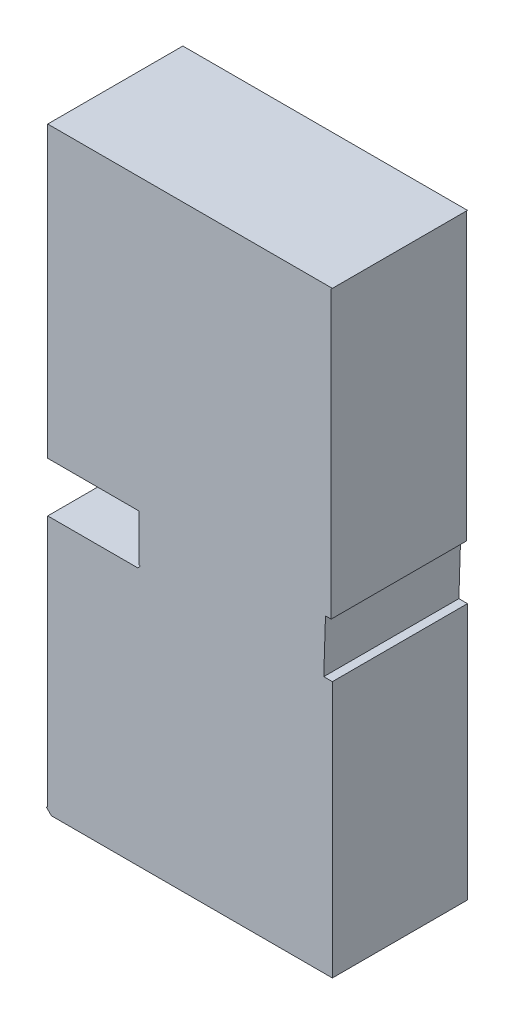
ISO-10303-21;
HEADER;
FILE_DESCRIPTION(('STEP AP214'),'2;1');
FILE_NAME('part.step','',(''),(''),'','','');
FILE_SCHEMA(('AUTOMOTIVE_DESIGN { 1 0 10303 214 1 1 1 1 }'));
ENDSEC;
DATA;
#1=APPLICATION_CONTEXT('core data for automotive mechanical design processes');
#2=APPLICATION_PROTOCOL_DEFINITION('international standard','automotive_design',2000,#1);
#3=PRODUCT_CONTEXT('',#1,'mechanical');
#4=PRODUCT('Part','Part','',(#3));
#5=PRODUCT_RELATED_PRODUCT_CATEGORY('part','',(#4));
#6=PRODUCT_DEFINITION_FORMATION('','',#4);
#7=PRODUCT_DEFINITION_CONTEXT('part definition',#1,'design');
#8=PRODUCT_DEFINITION('design','',#6,#7);
#9=PRODUCT_DEFINITION_SHAPE('','',#8);
#10=(LENGTH_UNIT() NAMED_UNIT(*) SI_UNIT(.MILLI.,.METRE.));
#11=(NAMED_UNIT(*) PLANE_ANGLE_UNIT() SI_UNIT($,.RADIAN.));
#12=(NAMED_UNIT(*) SI_UNIT($,.STERADIAN.) SOLID_ANGLE_UNIT());
#13=UNCERTAINTY_MEASURE_WITH_UNIT(LENGTH_MEASURE(1.E-05),#10,'distance_accuracy_value','');
#14=(GEOMETRIC_REPRESENTATION_CONTEXT(3) GLOBAL_UNCERTAINTY_ASSIGNED_CONTEXT((#13)) GLOBAL_UNIT_ASSIGNED_CONTEXT((#10,
#11,#12)) REPRESENTATION_CONTEXT('',''));
#15=CARTESIAN_POINT('',(0.,0.,0.));
#16=DIRECTION('',(0.,0.,1.));
#17=DIRECTION('',(1.,0.,0.));
#18=AXIS2_PLACEMENT_3D('',#15,#16,#17);
#19=CARTESIAN_POINT('',(1.1635613,2.4310975,1.10000034));
#20=DIRECTION('',(0.,0.,-1.));
#21=DIRECTION('',(0.,-1.,0.));
#22=AXIS2_PLACEMENT_3D('',#19,#20,#21);
#23=PLANE('',#22);
#24=DIRECTION('',(-0.707106781186548,-0.707106781186548,0.));
#25=VECTOR('',#24,1.);
#26=CARTESIAN_POINT('',(1.1635613,2.4310975,1.10000034));
#27=LINE('',#26,#25);
#28=CARTESIAN_POINT('',(1.1635613,2.4310975,1.10000034));
#29=VERTEX_POINT('',#28);
#30=CARTESIAN_POINT('',(1.1536553,2.4211915,1.10000034));
#31=VERTEX_POINT('',#30);
#32=EDGE_CURVE('E294',#29,#31,#27,.T.);
#33=ORIENTED_EDGE('',*,*,#32,.F.);
#34=DIRECTION('',(1.,0.,0.));
#35=VECTOR('',#34,1.);
#36=CARTESIAN_POINT('',(-1.1536807,2.4310975,1.10000034));
#37=LINE('',#36,#35);
#38=CARTESIAN_POINT('',(-1.1536807,2.4310975,1.10000034));
#39=VERTEX_POINT('',#38);
#40=EDGE_CURVE('E28',#39,#29,#37,.T.);
#41=ORIENTED_EDGE('',*,*,#40,.F.);
#42=DIRECTION('',(0.,1.,0.));
#43=VECTOR('',#42,1.);
#44=CARTESIAN_POINT('',(-1.1536807,0.0742569,1.10000034));
#45=LINE('',#44,#43);
#46=CARTESIAN_POINT('',(-1.1536807,0.0742569,1.10000034));
#47=VERTEX_POINT('',#46);
#48=EDGE_CURVE('E285',#47,#39,#45,.T.);
#49=ORIENTED_EDGE('',*,*,#48,.F.);
#50=DIRECTION('',(-1.,0.,0.));
#51=VECTOR('',#50,1.);
#52=CARTESIAN_POINT('',(-0.4109847,0.0742569,1.10000034));
#53=LINE('',#52,#51);
#54=CARTESIAN_POINT('',(-0.4109847,0.0742569,1.10000034));
#55=VERTEX_POINT('',#54);
#56=EDGE_CURVE('E270',#55,#47,#53,.T.);
#57=ORIENTED_EDGE('',*,*,#56,.F.);
#58=DIRECTION('',(0.,1.,0.));
#59=VECTOR('',#58,1.);
#60=CARTESIAN_POINT('',(-0.4109847,-0.3020441,1.10000034));
#61=LINE('',#60,#59);
#62=CARTESIAN_POINT('',(-0.4109847,-0.3020441,1.10000034));
#63=VERTEX_POINT('',#62);
#64=EDGE_CURVE('E259',#63,#55,#61,.T.);
#65=ORIENTED_EDGE('',*,*,#64,.F.);
#66=DIRECTION('',(-0.707106781186548,0.707106781186548,0.));
#67=VECTOR('',#66,1.);
#68=CARTESIAN_POINT('',(-0.4010787,-0.3119501,1.10000034));
#69=LINE('',#68,#67);
#70=CARTESIAN_POINT('',(-0.4010787,-0.3119501,1.10000034));
#71=VERTEX_POINT('',#70);
#72=EDGE_CURVE('E177',#71,#63,#69,.T.);
#73=ORIENTED_EDGE('',*,*,#72,.F.);
#74=DIRECTION('',(0.707106781186548,0.707106781186548,0.));
#75=VECTOR('',#74,1.);
#76=CARTESIAN_POINT('',(-0.4208653,-0.3317367,1.10000034));
#77=LINE('',#76,#75);
#78=CARTESIAN_POINT('',(-0.4208653,-0.3317367,1.10000034));
#79=VERTEX_POINT('',#78);
#80=EDGE_CURVE('E170',#79,#71,#77,.T.);
#81=ORIENTED_EDGE('',*,*,#80,.F.);
#82=DIRECTION('',(1.,0.,0.));
#83=VECTOR('',#82,1.);
#84=CARTESIAN_POINT('',(-1.1536807,-0.3317367,1.10000034));
#85=LINE('',#84,#83);
#86=CARTESIAN_POINT('',(-1.1536807,-0.3317367,1.10000034));
#87=VERTEX_POINT('',#86);
#88=EDGE_CURVE('E174',#87,#79,#85,.T.);
#89=ORIENTED_EDGE('',*,*,#88,.F.);
#90=DIRECTION('',(0.,1.,0.));
#91=VECTOR('',#90,1.);
#92=CARTESIAN_POINT('',(-1.1536807,-2.3816183,1.10000034));
#93=LINE('',#92,#91);
#94=CARTESIAN_POINT('',(-1.1536807,-2.3816183,1.10000034));
#95=VERTEX_POINT('',#94);
#96=EDGE_CURVE('E233',#95,#87,#93,.T.);
#97=ORIENTED_EDGE('',*,*,#96,.F.);
#98=DIRECTION('',(0.707106781186548,0.707106781186548,0.));
#99=VECTOR('',#98,1.);
#100=CARTESIAN_POINT('',(-1.1635613,-2.3914989,1.10000034));
#101=LINE('',#100,#99);
#102=CARTESIAN_POINT('',(-1.1635613,-2.3914989,1.10000034));
#103=VERTEX_POINT('',#102);
#104=EDGE_CURVE('E271',#103,#95,#101,.T.);
#105=ORIENTED_EDGE('',*,*,#104,.F.);
#106=DIRECTION('',(-0.707106781186548,0.707106781186548,0.));
#107=VECTOR('',#106,1.);
#108=CARTESIAN_POINT('',(-1.1239627,-2.4310975,1.10000034));
#109=LINE('',#108,#107);
#110=CARTESIAN_POINT('',(-1.1239627,-2.4310975,1.10000034));
#111=VERTEX_POINT('',#110);
#112=EDGE_CURVE('E225',#111,#103,#109,.T.);
#113=ORIENTED_EDGE('',*,*,#112,.F.);
#114=DIRECTION('',(-1.,0.,0.));
#115=VECTOR('',#114,1.);
#116=CARTESIAN_POINT('',(1.1635613,-2.4310975,1.10000034));
#117=LINE('',#116,#115);
#118=CARTESIAN_POINT('',(1.1635613,-2.4310975,1.10000034));
#119=VERTEX_POINT('',#118);
#120=EDGE_CURVE('E254',#119,#111,#117,.T.);
#121=ORIENTED_EDGE('',*,*,#120,.F.);
#122=DIRECTION('',(0.,-1.,0.));
#123=VECTOR('',#122,1.);
#124=CARTESIAN_POINT('',(1.1635613,-0.3416427,1.10000034));
#125=LINE('',#124,#123);
#126=CARTESIAN_POINT('',(1.1635613,-0.3416427,1.10000034));
#127=VERTEX_POINT('',#126);
#128=EDGE_CURVE('E242',#127,#119,#125,.T.);
#129=ORIENTED_EDGE('',*,*,#128,.F.);
#130=DIRECTION('',(1.,0.,0.));
#131=VECTOR('',#130,1.);
#132=CARTESIAN_POINT('',(1.09340904,-0.3416427,1.10000034));
#133=LINE('',#132,#131);
#134=CARTESIAN_POINT('',(1.09340904,-0.3416427,1.10000034));
#135=VERTEX_POINT('',#134);
#136=EDGE_CURVE('E213',#135,#127,#133,.T.);
#137=ORIENTED_EDGE('',*,*,#136,.F.);
#138=DIRECTION('',(-0.0322887852650993,-0.999478581234287,0.));
#139=VECTOR('',#138,1.);
#140=CARTESIAN_POINT('',(1.10748826,0.0941705,1.10000034));
#141=LINE('',#140,#139);
#142=CARTESIAN_POINT('',(1.10748826,0.0941705,1.10000034));
#143=VERTEX_POINT('',#142);
#144=EDGE_CURVE('E221',#143,#135,#141,.T.);
#145=ORIENTED_EDGE('',*,*,#144,.F.);
#146=DIRECTION('',(-0.999997578459252,0.00220069889625955,0.));
#147=VECTOR('',#146,1.);
#148=CARTESIAN_POINT('',(1.1536553,0.0940689,1.10000034));
#149=LINE('',#148,#147);
#150=CARTESIAN_POINT('',(1.1536553,0.0940689,1.10000034));
#151=VERTEX_POINT('',#150);
#152=EDGE_CURVE('E220',#151,#143,#149,.T.);
#153=ORIENTED_EDGE('',*,*,#152,.F.);
#154=DIRECTION('',(0.,-1.,0.));
#155=VECTOR('',#154,1.);
#156=CARTESIAN_POINT('',(1.1536553,2.4211915,1.10000034));
#157=LINE('',#156,#155);
#158=EDGE_CURVE('E240',#31,#151,#157,.T.);
#159=ORIENTED_EDGE('',*,*,#158,.F.);
#160=EDGE_LOOP('',(#33,#41,#49,#57,#65,#73,#81,#89,#97,#105,#113,#121,#129,#137,#145,#153,#159));
#161=FACE_BOUND('',#160,.T.);
#162=ADVANCED_FACE('F17',(#161),#23,.F.);
#163=CARTESIAN_POINT('',(1.1635613,2.4310975,0.));
#164=DIRECTION('',(0.,0.,-1.));
#165=DIRECTION('',(0.,-1.,0.));
#166=AXIS2_PLACEMENT_3D('',#163,#164,#165);
#167=PLANE('',#166);
#168=DIRECTION('',(-0.707106781186548,-0.707106781186548,0.));
#169=VECTOR('',#168,1.);
#170=CARTESIAN_POINT('',(1.1635613,2.4310975,0.));
#171=LINE('',#170,#169);
#172=CARTESIAN_POINT('',(1.1635613,2.4310975,0.));
#173=VERTEX_POINT('',#172);
#174=CARTESIAN_POINT('',(1.1536553,2.4211915,0.));
#175=VERTEX_POINT('',#174);
#176=EDGE_CURVE('E236',#173,#175,#171,.T.);
#177=ORIENTED_EDGE('',*,*,#176,.T.);
#178=DIRECTION('',(0.,-1.,0.));
#179=VECTOR('',#178,1.);
#180=CARTESIAN_POINT('',(1.1536553,2.4211915,0.));
#181=LINE('',#180,#179);
#182=CARTESIAN_POINT('',(1.1536553,0.0940689,0.));
#183=VERTEX_POINT('',#182);
#184=EDGE_CURVE('E280',#175,#183,#181,.T.);
#185=ORIENTED_EDGE('',*,*,#184,.T.);
#186=DIRECTION('',(-0.999997578459252,0.00220069889625955,0.));
#187=VECTOR('',#186,1.);
#188=CARTESIAN_POINT('',(1.1536553,0.0940689,0.));
#189=LINE('',#188,#187);
#190=CARTESIAN_POINT('',(1.10748826,0.0941705,0.));
#191=VERTEX_POINT('',#190);
#192=EDGE_CURVE('E219',#183,#191,#189,.T.);
#193=ORIENTED_EDGE('',*,*,#192,.T.);
#194=DIRECTION('',(-0.0322887852650993,-0.999478581234287,0.));
#195=VECTOR('',#194,1.);
#196=CARTESIAN_POINT('',(1.10748826,0.0941705,0.));
#197=LINE('',#196,#195);
#198=CARTESIAN_POINT('',(1.09340904,-0.3416427,0.));
#199=VERTEX_POINT('',#198);
#200=EDGE_CURVE('E209',#191,#199,#197,.T.);
#201=ORIENTED_EDGE('',*,*,#200,.T.);
#202=DIRECTION('',(1.,0.,0.));
#203=VECTOR('',#202,1.);
#204=CARTESIAN_POINT('',(1.09340904,-0.3416427,0.));
#205=LINE('',#204,#203);
#206=CARTESIAN_POINT('',(1.1635613,-0.3416427,0.));
#207=VERTEX_POINT('',#206);
#208=EDGE_CURVE('E247',#199,#207,#205,.T.);
#209=ORIENTED_EDGE('',*,*,#208,.T.);
#210=DIRECTION('',(0.,-1.,0.));
#211=VECTOR('',#210,1.);
#212=CARTESIAN_POINT('',(1.1635613,-0.3416427,0.));
#213=LINE('',#212,#211);
#214=CARTESIAN_POINT('',(1.1635613,-2.4310975,0.));
#215=VERTEX_POINT('',#214);
#216=EDGE_CURVE('E320',#207,#215,#213,.T.);
#217=ORIENTED_EDGE('',*,*,#216,.T.);
#218=DIRECTION('',(-1.,0.,0.));
#219=VECTOR('',#218,1.);
#220=CARTESIAN_POINT('',(1.1635613,-2.4310975,0.));
#221=LINE('',#220,#219);
#222=CARTESIAN_POINT('',(-1.1239627,-2.4310975,0.));
#223=VERTEX_POINT('',#222);
#224=EDGE_CURVE('E230',#215,#223,#221,.T.);
#225=ORIENTED_EDGE('',*,*,#224,.T.);
#226=DIRECTION('',(-0.707106781186548,0.707106781186548,0.));
#227=VECTOR('',#226,1.);
#228=CARTESIAN_POINT('',(-1.1239627,-2.4310975,0.));
#229=LINE('',#228,#227);
#230=CARTESIAN_POINT('',(-1.1635613,-2.3914989,0.));
#231=VERTEX_POINT('',#230);
#232=EDGE_CURVE('E275',#223,#231,#229,.T.);
#233=ORIENTED_EDGE('',*,*,#232,.T.);
#234=DIRECTION('',(0.707106781186548,0.707106781186548,0.));
#235=VECTOR('',#234,1.);
#236=CARTESIAN_POINT('',(-1.1635613,-2.3914989,0.));
#237=LINE('',#236,#235);
#238=CARTESIAN_POINT('',(-1.1536807,-2.3816183,0.));
#239=VERTEX_POINT('',#238);
#240=EDGE_CURVE('E363',#231,#239,#237,.T.);
#241=ORIENTED_EDGE('',*,*,#240,.T.);
#242=DIRECTION('',(0.,1.,0.));
#243=VECTOR('',#242,1.);
#244=CARTESIAN_POINT('',(-1.1536807,-2.3816183,0.));
#245=LINE('',#244,#243);
#246=CARTESIAN_POINT('',(-1.1536807,-0.3317367,0.));
#247=VERTEX_POINT('',#246);
#248=EDGE_CURVE('E21',#239,#247,#245,.T.);
#249=ORIENTED_EDGE('',*,*,#248,.T.);
#250=DIRECTION('',(1.,0.,0.));
#251=VECTOR('',#250,1.);
#252=CARTESIAN_POINT('',(-1.1536807,-0.3317367,0.));
#253=LINE('',#252,#251);
#254=CARTESIAN_POINT('',(-0.4208653,-0.3317367,0.));
#255=VERTEX_POINT('',#254);
#256=EDGE_CURVE('E183',#247,#255,#253,.T.);
#257=ORIENTED_EDGE('',*,*,#256,.T.);
#258=DIRECTION('',(0.707106781186548,0.707106781186548,0.));
#259=VECTOR('',#258,1.);
#260=CARTESIAN_POINT('',(-0.4208653,-0.3317367,0.));
#261=LINE('',#260,#259);
#262=CARTESIAN_POINT('',(-0.4010787,-0.3119501,0.));
#263=VERTEX_POINT('',#262);
#264=EDGE_CURVE('E189',#255,#263,#261,.T.);
#265=ORIENTED_EDGE('',*,*,#264,.T.);
#266=DIRECTION('',(-0.707106781186548,0.707106781186548,0.));
#267=VECTOR('',#266,1.);
#268=CARTESIAN_POINT('',(-0.4010787,-0.3119501,0.));
#269=LINE('',#268,#267);
#270=CARTESIAN_POINT('',(-0.4109847,-0.3020441,0.));
#271=VERTEX_POINT('',#270);
#272=EDGE_CURVE('E255',#263,#271,#269,.T.);
#273=ORIENTED_EDGE('',*,*,#272,.T.);
#274=DIRECTION('',(0.,1.,0.));
#275=VECTOR('',#274,1.);
#276=CARTESIAN_POINT('',(-0.4109847,-0.3020441,0.));
#277=LINE('',#276,#275);
#278=CARTESIAN_POINT('',(-0.4109847,0.0742569,0.));
#279=VERTEX_POINT('',#278);
#280=EDGE_CURVE('E316',#271,#279,#277,.T.);
#281=ORIENTED_EDGE('',*,*,#280,.T.);
#282=DIRECTION('',(-1.,0.,0.));
#283=VECTOR('',#282,1.);
#284=CARTESIAN_POINT('',(-0.4109847,0.0742569,0.));
#285=LINE('',#284,#283);
#286=CARTESIAN_POINT('',(-1.1536807,0.0742569,0.));
#287=VERTEX_POINT('',#286);
#288=EDGE_CURVE('E269',#279,#287,#285,.T.);
#289=ORIENTED_EDGE('',*,*,#288,.T.);
#290=DIRECTION('',(0.,1.,0.));
#291=VECTOR('',#290,1.);
#292=CARTESIAN_POINT('',(-1.1536807,0.0742569,0.));
#293=LINE('',#292,#291);
#294=CARTESIAN_POINT('',(-1.1536807,2.4310975,0.));
#295=VERTEX_POINT('',#294);
#296=EDGE_CURVE('E309',#287,#295,#293,.T.);
#297=ORIENTED_EDGE('',*,*,#296,.T.);
#298=DIRECTION('',(1.,0.,0.));
#299=VECTOR('',#298,1.);
#300=CARTESIAN_POINT('',(-1.1536807,2.4310975,0.));
#301=LINE('',#300,#299);
#302=EDGE_CURVE('E11',#295,#173,#301,.T.);
#303=ORIENTED_EDGE('',*,*,#302,.T.);
#304=EDGE_LOOP('',(#177,#185,#193,#201,#209,#217,#225,#233,#241,#249,#257,#265,#273,#281,#289,
#297,#303));
#305=FACE_BOUND('',#304,.T.);
#306=ADVANCED_FACE('F332',(#305),#167,.T.);
#307=CARTESIAN_POINT('',(-1.1536807,2.4310975,0.));
#308=DIRECTION('',(0.,1.,0.));
#309=DIRECTION('',(1.,0.,0.));
#310=AXIS2_PLACEMENT_3D('',#307,#308,#309);
#311=PLANE('',#310);
#312=DIRECTION('',(0.,0.,1.));
#313=VECTOR('',#312,1.);
#314=CARTESIAN_POINT('',(-1.1536807,2.4310975,0.));
#315=LINE('',#314,#313);
#316=EDGE_CURVE('E288',#295,#39,#315,.T.);
#317=ORIENTED_EDGE('',*,*,#316,.T.);
#318=ORIENTED_EDGE('',*,*,#40,.T.);
#319=DIRECTION('',(0.,0.,1.));
#320=VECTOR('',#319,1.);
#321=CARTESIAN_POINT('',(1.1635613,2.4310975,0.));
#322=LINE('',#321,#320);
#323=EDGE_CURVE('E290',#173,#29,#322,.T.);
#324=ORIENTED_EDGE('',*,*,#323,.F.);
#325=ORIENTED_EDGE('',*,*,#302,.F.);
#326=EDGE_LOOP('',(#317,#318,#324,#325));
#327=FACE_BOUND('',#326,.T.);
#328=ADVANCED_FACE('F575',(#327),#311,.T.);
#329=CARTESIAN_POINT('',(-1.1536807,0.0742569,0.));
#330=DIRECTION('',(-1.,0.,0.));
#331=DIRECTION('',(0.,0.,1.));
#332=AXIS2_PLACEMENT_3D('',#329,#330,#331);
#333=PLANE('',#332);
#334=DIRECTION('',(0.,0.,1.));
#335=VECTOR('',#334,1.);
#336=CARTESIAN_POINT('',(-1.1536807,0.0742569,0.));
#337=LINE('',#336,#335);
#338=EDGE_CURVE('E265',#287,#47,#337,.T.);
#339=ORIENTED_EDGE('',*,*,#338,.T.);
#340=ORIENTED_EDGE('',*,*,#48,.T.);
#341=ORIENTED_EDGE('',*,*,#316,.F.);
#342=ORIENTED_EDGE('',*,*,#296,.F.);
#343=EDGE_LOOP('',(#339,#340,#341,#342));
#344=FACE_BOUND('',#343,.T.);
#345=ADVANCED_FACE('F339',(#344),#333,.T.);
#346=CARTESIAN_POINT('',(-0.4109847,0.0742569,0.));
#347=DIRECTION('',(0.,-1.,0.));
#348=DIRECTION('',(0.,0.,-1.));
#349=AXIS2_PLACEMENT_3D('',#346,#347,#348);
#350=PLANE('',#349);
#351=DIRECTION('',(0.,0.,1.));
#352=VECTOR('',#351,1.);
#353=CARTESIAN_POINT('',(-0.4109847,0.0742569,0.));
#354=LINE('',#353,#352);
#355=EDGE_CURVE('E264',#279,#55,#354,.T.);
#356=ORIENTED_EDGE('',*,*,#355,.T.);
#357=ORIENTED_EDGE('',*,*,#56,.T.);
#358=ORIENTED_EDGE('',*,*,#338,.F.);
#359=ORIENTED_EDGE('',*,*,#288,.F.);
#360=EDGE_LOOP('',(#356,#357,#358,#359));
#361=FACE_BOUND('',#360,.T.);
#362=ADVANCED_FACE('F337',(#361),#350,.T.);
#363=CARTESIAN_POINT('',(-0.4109847,-0.3020441,0.));
#364=DIRECTION('',(-1.,0.,0.));
#365=DIRECTION('',(0.,0.,1.));
#366=AXIS2_PLACEMENT_3D('',#363,#364,#365);
#367=PLANE('',#366);
#368=DIRECTION('',(0.,0.,1.));
#369=VECTOR('',#368,1.);
#370=CARTESIAN_POINT('',(-0.4109847,-0.3020441,0.));
#371=LINE('',#370,#369);
#372=EDGE_CURVE('E260',#271,#63,#371,.T.);
#373=ORIENTED_EDGE('',*,*,#372,.T.);
#374=ORIENTED_EDGE('',*,*,#64,.T.);
#375=ORIENTED_EDGE('',*,*,#355,.F.);
#376=ORIENTED_EDGE('',*,*,#280,.F.);
#377=EDGE_LOOP('',(#373,#374,#375,#376));
#378=FACE_BOUND('',#377,.T.);
#379=ADVANCED_FACE('F621',(#378),#367,.T.);
#380=CARTESIAN_POINT('',(-0.4010787,-0.3119501,0.));
#381=DIRECTION('',(-0.707106781186548,-0.707106781186548,0.));
#382=DIRECTION('',(-0.707106781186548,0.707106781186548,0.));
#383=AXIS2_PLACEMENT_3D('',#380,#381,#382);
#384=PLANE('',#383);
#385=DIRECTION('',(0.,0.,1.));
#386=VECTOR('',#385,1.);
#387=CARTESIAN_POINT('',(-0.4010787,-0.3119501,0.));
#388=LINE('',#387,#386);
#389=EDGE_CURVE('E182',#263,#71,#388,.T.);
#390=ORIENTED_EDGE('',*,*,#389,.T.);
#391=ORIENTED_EDGE('',*,*,#72,.T.);
#392=ORIENTED_EDGE('',*,*,#372,.F.);
#393=ORIENTED_EDGE('',*,*,#272,.F.);
#394=EDGE_LOOP('',(#390,#391,#392,#393));
#395=FACE_BOUND('',#394,.T.);
#396=ADVANCED_FACE('F588',(#395),#384,.T.);
#397=CARTESIAN_POINT('',(-0.4208653,-0.3317367,0.));
#398=DIRECTION('',(-0.707106781186548,0.707106781186548,0.));
#399=DIRECTION('',(0.,0.,1.));
#400=AXIS2_PLACEMENT_3D('',#397,#398,#399);
#401=PLANE('',#400);
#402=DIRECTION('',(0.,0.,1.));
#403=VECTOR('',#402,1.);
#404=CARTESIAN_POINT('',(-0.4208653,-0.3317367,0.));
#405=LINE('',#404,#403);
#406=EDGE_CURVE('E186',#255,#79,#405,.T.);
#407=ORIENTED_EDGE('',*,*,#406,.T.);
#408=ORIENTED_EDGE('',*,*,#80,.T.);
#409=ORIENTED_EDGE('',*,*,#389,.F.);
#410=ORIENTED_EDGE('',*,*,#264,.F.);
#411=EDGE_LOOP('',(#407,#408,#409,#410));
#412=FACE_BOUND('',#411,.T.);
#413=ADVANCED_FACE('F187',(#412),#401,.T.);
#414=CARTESIAN_POINT('',(-1.1536807,-0.3317367,0.));
#415=DIRECTION('',(0.,1.,0.));
#416=DIRECTION('',(1.,0.,0.));
#417=AXIS2_PLACEMENT_3D('',#414,#415,#416);
#418=PLANE('',#417);
#419=DIRECTION('',(0.,0.,1.));
#420=VECTOR('',#419,1.);
#421=CARTESIAN_POINT('',(-1.1536807,-0.3317367,0.));
#422=LINE('',#421,#420);
#423=EDGE_CURVE('E196',#247,#87,#422,.T.);
#424=ORIENTED_EDGE('',*,*,#423,.T.);
#425=ORIENTED_EDGE('',*,*,#88,.T.);
#426=ORIENTED_EDGE('',*,*,#406,.F.);
#427=ORIENTED_EDGE('',*,*,#256,.F.);
#428=EDGE_LOOP('',(#424,#425,#426,#427));
#429=FACE_BOUND('',#428,.T.);
#430=ADVANCED_FACE('F194',(#429),#418,.T.);
#431=CARTESIAN_POINT('',(-1.1536807,-2.3816183,0.));
#432=DIRECTION('',(-1.,0.,0.));
#433=DIRECTION('',(0.,0.,1.));
#434=AXIS2_PLACEMENT_3D('',#431,#432,#433);
#435=PLANE('',#434);
#436=DIRECTION('',(0.,0.,1.));
#437=VECTOR('',#436,1.);
#438=CARTESIAN_POINT('',(-1.1536807,-2.3816183,0.));
#439=LINE('',#438,#437);
#440=EDGE_CURVE('E207',#239,#95,#439,.T.);
#441=ORIENTED_EDGE('',*,*,#440,.T.);
#442=ORIENTED_EDGE('',*,*,#96,.T.);
#443=ORIENTED_EDGE('',*,*,#423,.F.);
#444=ORIENTED_EDGE('',*,*,#248,.F.);
#445=EDGE_LOOP('',(#441,#442,#443,#444));
#446=FACE_BOUND('',#445,.T.);
#447=ADVANCED_FACE('F538',(#446),#435,.T.);
#448=CARTESIAN_POINT('',(-1.1635613,-2.3914989,0.));
#449=DIRECTION('',(-0.707106781186548,0.707106781186548,0.));
#450=DIRECTION('',(0.,0.,1.));
#451=AXIS2_PLACEMENT_3D('',#448,#449,#450);
#452=PLANE('',#451);
#453=DIRECTION('',(0.,0.,1.));
#454=VECTOR('',#453,1.);
#455=CARTESIAN_POINT('',(-1.1635613,-2.3914989,0.));
#456=LINE('',#455,#454);
#457=EDGE_CURVE('E229',#231,#103,#456,.T.);
#458=ORIENTED_EDGE('',*,*,#457,.T.);
#459=ORIENTED_EDGE('',*,*,#104,.T.);
#460=ORIENTED_EDGE('',*,*,#440,.F.);
#461=ORIENTED_EDGE('',*,*,#240,.F.);
#462=EDGE_LOOP('',(#458,#459,#460,#461));
#463=FACE_BOUND('',#462,.T.);
#464=ADVANCED_FACE('F555',(#463),#452,.T.);
#465=CARTESIAN_POINT('',(-1.1239627,-2.4310975,0.));
#466=DIRECTION('',(-0.707106781186548,-0.707106781186548,0.));
#467=DIRECTION('',(-0.707106781186548,0.707106781186548,0.));
#468=AXIS2_PLACEMENT_3D('',#465,#466,#467);
#469=PLANE('',#468);
#470=DIRECTION('',(0.,0.,1.));
#471=VECTOR('',#470,1.);
#472=CARTESIAN_POINT('',(-1.1239627,-2.4310975,0.));
#473=LINE('',#472,#471);
#474=EDGE_CURVE('E250',#223,#111,#473,.T.);
#475=ORIENTED_EDGE('',*,*,#474,.T.);
#476=ORIENTED_EDGE('',*,*,#112,.T.);
#477=ORIENTED_EDGE('',*,*,#457,.F.);
#478=ORIENTED_EDGE('',*,*,#232,.F.);
#479=EDGE_LOOP('',(#475,#476,#477,#478));
#480=FACE_BOUND('',#479,.T.);
#481=ADVANCED_FACE('F560',(#480),#469,.T.);
#482=CARTESIAN_POINT('',(1.1635613,-2.4310975,0.));
#483=DIRECTION('',(0.,-1.,0.));
#484=DIRECTION('',(0.,0.,-1.));
#485=AXIS2_PLACEMENT_3D('',#482,#483,#484);
#486=PLANE('',#485);
#487=DIRECTION('',(0.,0.,1.));
#488=VECTOR('',#487,1.);
#489=CARTESIAN_POINT('',(1.1635613,-2.4310975,0.));
#490=LINE('',#489,#488);
#491=EDGE_CURVE('E246',#215,#119,#490,.T.);
#492=ORIENTED_EDGE('',*,*,#491,.T.);
#493=ORIENTED_EDGE('',*,*,#120,.T.);
#494=ORIENTED_EDGE('',*,*,#474,.F.);
#495=ORIENTED_EDGE('',*,*,#224,.F.);
#496=EDGE_LOOP('',(#492,#493,#494,#495));
#497=FACE_BOUND('',#496,.T.);
#498=ADVANCED_FACE('F569',(#497),#486,.T.);
#499=CARTESIAN_POINT('',(1.1635613,-0.3416427,0.));
#500=DIRECTION('',(1.,0.,0.));
#501=DIRECTION('',(0.,1.,0.));
#502=AXIS2_PLACEMENT_3D('',#499,#500,#501);
#503=PLANE('',#502);
#504=DIRECTION('',(0.,0.,1.));
#505=VECTOR('',#504,1.);
#506=CARTESIAN_POINT('',(1.1635613,-0.3416427,0.));
#507=LINE('',#506,#505);
#508=EDGE_CURVE('E284',#207,#127,#507,.T.);
#509=ORIENTED_EDGE('',*,*,#508,.T.);
#510=ORIENTED_EDGE('',*,*,#128,.T.);
#511=ORIENTED_EDGE('',*,*,#491,.F.);
#512=ORIENTED_EDGE('',*,*,#216,.F.);
#513=EDGE_LOOP('',(#509,#510,#511,#512));
#514=FACE_BOUND('',#513,.T.);
#515=ADVANCED_FACE('F600',(#514),#503,.T.);
#516=CARTESIAN_POINT('',(1.09340904,-0.3416427,0.));
#517=DIRECTION('',(0.,1.,0.));
#518=DIRECTION('',(1.,0.,0.));
#519=AXIS2_PLACEMENT_3D('',#516,#517,#518);
#520=PLANE('',#519);
#521=DIRECTION('',(0.,0.,1.));
#522=VECTOR('',#521,1.);
#523=CARTESIAN_POINT('',(1.09340904,-0.3416427,0.));
#524=LINE('',#523,#522);
#525=EDGE_CURVE('E214',#199,#135,#524,.T.);
#526=ORIENTED_EDGE('',*,*,#525,.T.);
#527=ORIENTED_EDGE('',*,*,#136,.T.);
#528=ORIENTED_EDGE('',*,*,#508,.F.);
#529=ORIENTED_EDGE('',*,*,#208,.F.);
#530=EDGE_LOOP('',(#526,#527,#528,#529));
#531=FACE_BOUND('',#530,.T.);
#532=ADVANCED_FACE('F605',(#531),#520,.T.);
#533=CARTESIAN_POINT('',(1.10748826,0.0941705,0.));
#534=DIRECTION('',(0.999478581234287,-0.0322887852650993,0.));
#535=DIRECTION('',(0.,0.,-1.));
#536=AXIS2_PLACEMENT_3D('',#533,#534,#535);
#537=PLANE('',#536);
#538=DIRECTION('',(0.,0.,1.));
#539=VECTOR('',#538,1.);
#540=CARTESIAN_POINT('',(1.10748826,0.0941705,0.));
#541=LINE('',#540,#539);
#542=EDGE_CURVE('E215',#191,#143,#541,.T.);
#543=ORIENTED_EDGE('',*,*,#542,.T.);
#544=ORIENTED_EDGE('',*,*,#144,.T.);
#545=ORIENTED_EDGE('',*,*,#525,.F.);
#546=ORIENTED_EDGE('',*,*,#200,.F.);
#547=EDGE_LOOP('',(#543,#544,#545,#546));
#548=FACE_BOUND('',#547,.T.);
#549=ADVANCED_FACE('F385',(#548),#537,.T.);
#550=CARTESIAN_POINT('',(1.1536553,0.0940689,0.));
#551=DIRECTION('',(-0.00220069889625955,-0.999997578459252,0.));
#552=DIRECTION('',(-0.999997578459252,0.00220069889625955,0.));
#553=AXIS2_PLACEMENT_3D('',#550,#551,#552);
#554=PLANE('',#553);
#555=DIRECTION('',(0.,0.,1.));
#556=VECTOR('',#555,1.);
#557=CARTESIAN_POINT('',(1.1536553,0.0940689,0.));
#558=LINE('',#557,#556);
#559=EDGE_CURVE('E276',#183,#151,#558,.T.);
#560=ORIENTED_EDGE('',*,*,#559,.T.);
#561=ORIENTED_EDGE('',*,*,#152,.T.);
#562=ORIENTED_EDGE('',*,*,#542,.F.);
#563=ORIENTED_EDGE('',*,*,#192,.F.);
#564=EDGE_LOOP('',(#560,#561,#562,#563));
#565=FACE_BOUND('',#564,.T.);
#566=ADVANCED_FACE('F19',(#565),#554,.T.);
#567=CARTESIAN_POINT('',(1.1536553,2.4211915,0.));
#568=DIRECTION('',(1.,0.,0.));
#569=DIRECTION('',(0.,1.,0.));
#570=AXIS2_PLACEMENT_3D('',#567,#568,#569);
#571=PLANE('',#570);
#572=DIRECTION('',(0.,0.,1.));
#573=VECTOR('',#572,1.);
#574=CARTESIAN_POINT('',(1.1536553,2.4211915,0.));
#575=LINE('',#574,#573);
#576=EDGE_CURVE('E241',#175,#31,#575,.T.);
#577=ORIENTED_EDGE('',*,*,#576,.T.);
#578=ORIENTED_EDGE('',*,*,#158,.T.);
#579=ORIENTED_EDGE('',*,*,#559,.F.);
#580=ORIENTED_EDGE('',*,*,#184,.F.);
#581=EDGE_LOOP('',(#577,#578,#579,#580));
#582=FACE_BOUND('',#581,.T.);
#583=ADVANCED_FACE('F544',(#582),#571,.T.);
#584=CARTESIAN_POINT('',(1.1635613,2.4310975,0.));
#585=DIRECTION('',(0.707106781186548,-0.707106781186548,0.));
#586=DIRECTION('',(0.,0.,-1.));
#587=AXIS2_PLACEMENT_3D('',#584,#585,#586);
#588=PLANE('',#587);
#589=ORIENTED_EDGE('',*,*,#323,.T.);
#590=ORIENTED_EDGE('',*,*,#32,.T.);
#591=ORIENTED_EDGE('',*,*,#576,.F.);
#592=ORIENTED_EDGE('',*,*,#176,.F.);
#593=EDGE_LOOP('',(#589,#590,#591,#592));
#594=FACE_BOUND('',#593,.T.);
#595=ADVANCED_FACE('F549',(#594),#588,.T.);
#596=CLOSED_SHELL('',(#162,#306,#328,#345,#362,#379,#396,#413,#430,#447,#464,#481,#498,#515,
#532,#549,#566,#583,#595));
#597=MANIFOLD_SOLID_BREP('B1',#596);
#598=ADVANCED_BREP_SHAPE_REPRESENTATION('',(#18,#597),#14);
#599=SHAPE_DEFINITION_REPRESENTATION(#9,#598);
ENDSEC;
END-ISO-10303-21;
